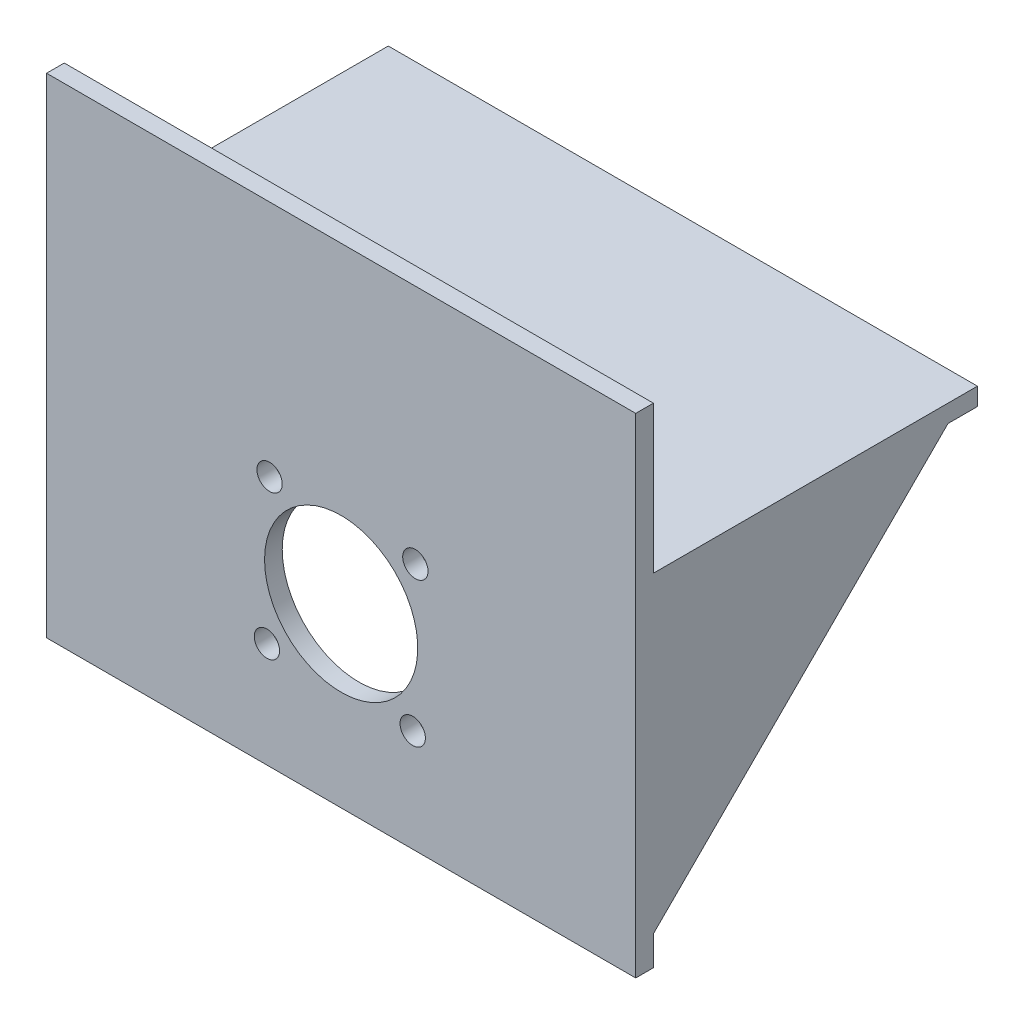
ISO-10303-21;
HEADER;
FILE_DESCRIPTION(('STEP AP214'),'2;1');
FILE_NAME('part.step','',(''),(''),'','','');
FILE_SCHEMA(('AUTOMOTIVE_DESIGN { 1 0 10303 214 1 1 1 1 }'));
ENDSEC;
DATA;
#1=APPLICATION_CONTEXT('core data for automotive mechanical design processes');
#2=APPLICATION_PROTOCOL_DEFINITION('international standard','automotive_design',2000,#1);
#3=PRODUCT_CONTEXT('',#1,'mechanical');
#4=PRODUCT('Part','Part','',(#3));
#5=PRODUCT_RELATED_PRODUCT_CATEGORY('part','',(#4));
#6=PRODUCT_DEFINITION_FORMATION('','',#4);
#7=PRODUCT_DEFINITION_CONTEXT('part definition',#1,'design');
#8=PRODUCT_DEFINITION('design','',#6,#7);
#9=PRODUCT_DEFINITION_SHAPE('','',#8);
#10=(LENGTH_UNIT() NAMED_UNIT(*) SI_UNIT(.MILLI.,.METRE.));
#11=(NAMED_UNIT(*) PLANE_ANGLE_UNIT() SI_UNIT($,.RADIAN.));
#12=(NAMED_UNIT(*) SI_UNIT($,.STERADIAN.) SOLID_ANGLE_UNIT());
#13=UNCERTAINTY_MEASURE_WITH_UNIT(LENGTH_MEASURE(1.E-05),#10,'distance_accuracy_value','');
#14=(GEOMETRIC_REPRESENTATION_CONTEXT(3) GLOBAL_UNCERTAINTY_ASSIGNED_CONTEXT((#13)) GLOBAL_UNIT_ASSIGNED_CONTEXT((#10,
#11,#12)) REPRESENTATION_CONTEXT('',''));
#15=CARTESIAN_POINT('',(0.,0.,0.));
#16=DIRECTION('',(0.,0.,1.));
#17=DIRECTION('',(1.,0.,0.));
#18=AXIS2_PLACEMENT_3D('',#15,#16,#17);
#19=CARTESIAN_POINT('',(-50.,3.,-27.5));
#20=DIRECTION('',(1.,0.,0.));
#21=DIRECTION('',(0.,0.,-1.));
#22=AXIS2_PLACEMENT_3D('',#19,#20,#21);
#23=PLANE('',#22);
#24=DIRECTION('',(0.,0.,1.));
#25=VECTOR('',#24,1.);
#26=CARTESIAN_POINT('',(-50.,0.,-27.5));
#27=LINE('',#26,#25);
#28=CARTESIAN_POINT('',(-50.,0.,-27.5));
#29=VERTEX_POINT('',#28);
#30=CARTESIAN_POINT('',(-50.,0.,-22.5));
#31=VERTEX_POINT('',#30);
#32=EDGE_CURVE('E222',#29,#31,#27,.T.);
#33=ORIENTED_EDGE('',*,*,#32,.T.);
#34=DIRECTION('',(0.,-0.707106781186547,0.707106781186547));
#35=VECTOR('',#34,1.);
#36=CARTESIAN_POINT('',(-50.,-50.,27.5));
#37=LINE('',#36,#35);
#38=CARTESIAN_POINT('',(-50.,-50.,27.5));
#39=VERTEX_POINT('',#38);
#40=EDGE_CURVE('E52',#31,#39,#37,.T.);
#41=ORIENTED_EDGE('',*,*,#40,.T.);
#42=DIRECTION('',(0.,-1.,0.));
#43=VECTOR('',#42,1.);
#44=CARTESIAN_POINT('',(-50.,28.,27.5));
#45=LINE('',#44,#43);
#46=CARTESIAN_POINT('',(-50.,-55.,27.5));
#47=VERTEX_POINT('',#46);
#48=EDGE_CURVE('E176',#39,#47,#45,.T.);
#49=ORIENTED_EDGE('',*,*,#48,.T.);
#50=DIRECTION('',(0.,0.,-1.));
#51=VECTOR('',#50,1.);
#52=CARTESIAN_POINT('',(-50.,-55.,30.5));
#53=LINE('',#52,#51);
#54=CARTESIAN_POINT('',(-50.,-55.,30.5));
#55=VERTEX_POINT('',#54);
#56=EDGE_CURVE('E201',#55,#47,#53,.T.);
#57=ORIENTED_EDGE('',*,*,#56,.F.);
#58=DIRECTION('',(0.,-1.,0.));
#59=VECTOR('',#58,1.);
#60=CARTESIAN_POINT('',(-50.,28.,30.5));
#61=LINE('',#60,#59);
#62=CARTESIAN_POINT('',(-50.,28.,30.5));
#63=VERTEX_POINT('',#62);
#64=EDGE_CURVE('E179',#63,#55,#61,.T.);
#65=ORIENTED_EDGE('',*,*,#64,.F.);
#66=DIRECTION('',(0.,0.,-1.));
#67=VECTOR('',#66,1.);
#68=CARTESIAN_POINT('',(-50.,28.,30.5));
#69=LINE('',#68,#67);
#70=CARTESIAN_POINT('',(-50.,28.,27.5));
#71=VERTEX_POINT('',#70);
#72=EDGE_CURVE('E189',#63,#71,#69,.T.);
#73=ORIENTED_EDGE('',*,*,#72,.T.);
#74=CARTESIAN_POINT('',(-50.,3.,27.5));
#75=VERTEX_POINT('',#74);
#76=EDGE_CURVE('E197',#71,#75,#45,.T.);
#77=ORIENTED_EDGE('',*,*,#76,.T.);
#78=DIRECTION('',(0.,0.,1.));
#79=VECTOR('',#78,1.);
#80=CARTESIAN_POINT('',(-50.,3.,-27.5));
#81=LINE('',#80,#79);
#82=CARTESIAN_POINT('',(-50.,3.,-27.5));
#83=VERTEX_POINT('',#82);
#84=EDGE_CURVE('E236',#83,#75,#81,.T.);
#85=ORIENTED_EDGE('',*,*,#84,.F.);
#86=DIRECTION('',(0.,-1.,0.));
#87=VECTOR('',#86,1.);
#88=CARTESIAN_POINT('',(-50.,3.,-27.5));
#89=LINE('',#88,#87);
#90=EDGE_CURVE('E44',#83,#29,#89,.T.);
#91=ORIENTED_EDGE('',*,*,#90,.T.);
#92=EDGE_LOOP('',(#33,#41,#49,#57,#65,#73,#77,#85,#91));
#93=FACE_BOUND('',#92,.T.);
#94=ADVANCED_FACE('F35',(#93),#23,.F.);
#95=CARTESIAN_POINT('',(50.,3.,-27.5));
#96=DIRECTION('',(-1.,0.,0.));
#97=DIRECTION('',(0.,0.,1.));
#98=AXIS2_PLACEMENT_3D('',#95,#96,#97);
#99=PLANE('',#98);
#100=DIRECTION('',(0.,0.707106781186547,-0.707106781186547));
#101=VECTOR('',#100,1.);
#102=CARTESIAN_POINT('',(50.,0.,-22.5));
#103=LINE('',#102,#101);
#104=CARTESIAN_POINT('',(50.,-50.,27.5));
#105=VERTEX_POINT('',#104);
#106=CARTESIAN_POINT('',(50.,0.,-22.5));
#107=VERTEX_POINT('',#106);
#108=EDGE_CURVE('E162',#105,#107,#103,.T.);
#109=ORIENTED_EDGE('',*,*,#108,.T.);
#110=DIRECTION('',(0.,0.,-1.));
#111=VECTOR('',#110,1.);
#112=CARTESIAN_POINT('',(50.,0.,-27.5));
#113=LINE('',#112,#111);
#114=CARTESIAN_POINT('',(50.,0.,-27.5));
#115=VERTEX_POINT('',#114);
#116=EDGE_CURVE('E226',#107,#115,#113,.T.);
#117=ORIENTED_EDGE('',*,*,#116,.T.);
#118=DIRECTION('',(0.,-1.,0.));
#119=VECTOR('',#118,1.);
#120=CARTESIAN_POINT('',(50.,3.,-27.5));
#121=LINE('',#120,#119);
#122=CARTESIAN_POINT('',(50.,3.,-27.5));
#123=VERTEX_POINT('',#122);
#124=EDGE_CURVE('E11',#123,#115,#121,.T.);
#125=ORIENTED_EDGE('',*,*,#124,.F.);
#126=DIRECTION('',(0.,0.,-1.));
#127=VECTOR('',#126,1.);
#128=CARTESIAN_POINT('',(50.,3.,-27.5));
#129=LINE('',#128,#127);
#130=CARTESIAN_POINT('',(50.,3.,27.5));
#131=VERTEX_POINT('',#130);
#132=EDGE_CURVE('E244',#131,#123,#129,.T.);
#133=ORIENTED_EDGE('',*,*,#132,.F.);
#134=DIRECTION('',(0.,1.,0.));
#135=VECTOR('',#134,1.);
#136=CARTESIAN_POINT('',(50.,28.,27.5));
#137=LINE('',#136,#135);
#138=CARTESIAN_POINT('',(50.,28.,27.5));
#139=VERTEX_POINT('',#138);
#140=EDGE_CURVE('E81',#131,#139,#137,.T.);
#141=ORIENTED_EDGE('',*,*,#140,.T.);
#142=DIRECTION('',(0.,0.,-1.));
#143=VECTOR('',#142,1.);
#144=CARTESIAN_POINT('',(50.,28.,30.5));
#145=LINE('',#144,#143);
#146=CARTESIAN_POINT('',(50.,28.,30.5));
#147=VERTEX_POINT('',#146);
#148=EDGE_CURVE('E213',#147,#139,#145,.T.);
#149=ORIENTED_EDGE('',*,*,#148,.F.);
#150=DIRECTION('',(0.,1.,0.));
#151=VECTOR('',#150,1.);
#152=CARTESIAN_POINT('',(50.,28.,30.5));
#153=LINE('',#152,#151);
#154=CARTESIAN_POINT('',(50.,-55.,30.5));
#155=VERTEX_POINT('',#154);
#156=EDGE_CURVE('E185',#155,#147,#153,.T.);
#157=ORIENTED_EDGE('',*,*,#156,.F.);
#158=DIRECTION('',(0.,0.,-1.));
#159=VECTOR('',#158,1.);
#160=CARTESIAN_POINT('',(50.,-55.,30.5));
#161=LINE('',#160,#159);
#162=CARTESIAN_POINT('',(50.,-55.,27.5));
#163=VERTEX_POINT('',#162);
#164=EDGE_CURVE('E215',#155,#163,#161,.T.);
#165=ORIENTED_EDGE('',*,*,#164,.T.);
#166=EDGE_CURVE('E203',#163,#105,#137,.T.);
#167=ORIENTED_EDGE('',*,*,#166,.T.);
#168=EDGE_LOOP('',(#109,#117,#125,#133,#141,#149,#157,#165,#167));
#169=FACE_BOUND('',#168,.T.);
#170=ADVANCED_FACE('F249',(#169),#99,.F.);
#171=CARTESIAN_POINT('',(-50.,3.,-27.5));
#172=DIRECTION('',(0.,0.,1.));
#173=DIRECTION('',(1.,0.,0.));
#174=AXIS2_PLACEMENT_3D('',#171,#172,#173);
#175=PLANE('',#174);
#176=DIRECTION('',(-1.,0.,0.));
#177=VECTOR('',#176,1.);
#178=CARTESIAN_POINT('',(-50.,0.,-27.5));
#179=LINE('',#178,#177);
#180=EDGE_CURVE('E74',#115,#29,#179,.T.);
#181=ORIENTED_EDGE('',*,*,#180,.T.);
#182=ORIENTED_EDGE('',*,*,#90,.F.);
#183=DIRECTION('',(-1.,0.,0.));
#184=VECTOR('',#183,1.);
#185=CARTESIAN_POINT('',(-50.,3.,-27.5));
#186=LINE('',#185,#184);
#187=EDGE_CURVE('E61',#123,#83,#186,.T.);
#188=ORIENTED_EDGE('',*,*,#187,.F.);
#189=ORIENTED_EDGE('',*,*,#124,.T.);
#190=EDGE_LOOP('',(#181,#182,#188,#189));
#191=FACE_BOUND('',#190,.T.);
#192=ADVANCED_FACE('F250',(#191),#175,.F.);
#193=CARTESIAN_POINT('',(0.,3.,0.));
#194=DIRECTION('',(0.,1.,0.));
#195=DIRECTION('',(0.,0.,1.));
#196=AXIS2_PLACEMENT_3D('',#193,#194,#195);
#197=PLANE('',#196);
#198=ORIENTED_EDGE('',*,*,#84,.T.);
#199=DIRECTION('',(1.,0.,0.));
#200=VECTOR('',#199,1.);
#201=CARTESIAN_POINT('',(-50.,3.,27.5));
#202=LINE('',#201,#200);
#203=EDGE_CURVE('E238',#75,#131,#202,.T.);
#204=ORIENTED_EDGE('',*,*,#203,.T.);
#205=ORIENTED_EDGE('',*,*,#132,.T.);
#206=ORIENTED_EDGE('',*,*,#187,.T.);
#207=EDGE_LOOP('',(#198,#204,#205,#206));
#208=FACE_BOUND('',#207,.T.);
#209=ADVANCED_FACE('F248',(#208),#197,.T.);
#210=CARTESIAN_POINT('',(0.,0.,0.));
#211=DIRECTION('',(0.,1.,0.));
#212=DIRECTION('',(0.,0.,1.));
#213=AXIS2_PLACEMENT_3D('',#210,#211,#212);
#214=PLANE('',#213);
#215=DIRECTION('',(0.,0.,-1.));
#216=VECTOR('',#215,1.);
#217=CARTESIAN_POINT('',(-47.,0.,-22.5));
#218=LINE('',#217,#216);
#219=CARTESIAN_POINT('',(-47.,0.,27.5));
#220=VERTEX_POINT('',#219);
#221=CARTESIAN_POINT('',(-47.,0.,-22.5));
#222=VERTEX_POINT('',#221);
#223=EDGE_CURVE('E147',#220,#222,#218,.T.);
#224=ORIENTED_EDGE('',*,*,#223,.T.);
#225=DIRECTION('',(-1.,0.,0.));
#226=VECTOR('',#225,1.);
#227=CARTESIAN_POINT('',(-47.,0.,-22.5));
#228=LINE('',#227,#226);
#229=EDGE_CURVE('E134',#222,#31,#228,.T.);
#230=ORIENTED_EDGE('',*,*,#229,.T.);
#231=ORIENTED_EDGE('',*,*,#32,.F.);
#232=ORIENTED_EDGE('',*,*,#180,.F.);
#233=ORIENTED_EDGE('',*,*,#116,.F.);
#234=DIRECTION('',(1.,0.,0.));
#235=VECTOR('',#234,1.);
#236=CARTESIAN_POINT('',(47.,0.,-22.5));
#237=LINE('',#236,#235);
#238=CARTESIAN_POINT('',(47.,0.,-22.5));
#239=VERTEX_POINT('',#238);
#240=EDGE_CURVE('E174',#239,#107,#237,.T.);
#241=ORIENTED_EDGE('',*,*,#240,.F.);
#242=DIRECTION('',(0.,0.,1.));
#243=VECTOR('',#242,1.);
#244=CARTESIAN_POINT('',(47.,0.,27.5));
#245=LINE('',#244,#243);
#246=CARTESIAN_POINT('',(47.,0.,27.5));
#247=VERTEX_POINT('',#246);
#248=EDGE_CURVE('E169',#239,#247,#245,.T.);
#249=ORIENTED_EDGE('',*,*,#248,.T.);
#250=DIRECTION('',(1.,0.,0.));
#251=VECTOR('',#250,1.);
#252=CARTESIAN_POINT('',(-50.,0.,27.5));
#253=LINE('',#252,#251);
#254=EDGE_CURVE('E38',#220,#247,#253,.T.);
#255=ORIENTED_EDGE('',*,*,#254,.F.);
#256=EDGE_LOOP('',(#224,#230,#231,#232,#233,#241,#249,#255));
#257=FACE_BOUND('',#256,.T.);
#258=ADVANCED_FACE('F152',(#257),#214,.F.);
#259=CARTESIAN_POINT('',(0.,0.,27.5));
#260=DIRECTION('',(0.,0.,1.));
#261=DIRECTION('',(1.,0.,0.));
#262=AXIS2_PLACEMENT_3D('',#259,#260,#261);
#263=PLANE('',#262);
#264=CARTESIAN_POINT('',(12.5959087524342,-12.8512106487793,27.5));
#265=DIRECTION('',(0.,0.,-1.));
#266=DIRECTION('',(-1.,0.,0.));
#267=AXIS2_PLACEMENT_3D('',#264,#265,#266);
#268=CIRCLE('',#267,2.15);
#269=CARTESIAN_POINT('',(10.4459087524342,-12.8512106487793,27.5));
#270=VERTEX_POINT('',#269);
#271=EDGE_CURVE('E339',#270,#270,#268,.T.);
#272=ORIENTED_EDGE('',*,*,#271,.F.);
#273=EDGE_LOOP('',(#272));
#274=FACE_BOUND('',#273,.T.);
#275=CARTESIAN_POINT('',(12.1487893512206,-37.595908752435,27.5));
#276=DIRECTION('',(0.,0.,-1.));
#277=DIRECTION('',(-1.,0.,0.));
#278=AXIS2_PLACEMENT_3D('',#275,#276,#277);
#279=CIRCLE('',#278,2.15);
#280=CARTESIAN_POINT('',(9.99878935122061,-37.595908752435,27.5));
#281=VERTEX_POINT('',#280);
#282=EDGE_CURVE('E335',#281,#281,#279,.T.);
#283=ORIENTED_EDGE('',*,*,#282,.F.);
#284=EDGE_LOOP('',(#283));
#285=FACE_BOUND('',#284,.T.);
#286=CARTESIAN_POINT('',(-12.5959087524351,-37.1487893512213,27.5));
#287=DIRECTION('',(0.,0.,-1.));
#288=DIRECTION('',(-1.,0.,0.));
#289=AXIS2_PLACEMENT_3D('',#286,#287,#288);
#290=CIRCLE('',#289,2.15);
#291=CARTESIAN_POINT('',(-14.7459087524351,-37.1487893512213,27.5));
#292=VERTEX_POINT('',#291);
#293=EDGE_CURVE('E331',#292,#292,#290,.T.);
#294=ORIENTED_EDGE('',*,*,#293,.F.);
#295=EDGE_LOOP('',(#294));
#296=FACE_BOUND('',#295,.T.);
#297=CARTESIAN_POINT('',(-12.1487893512213,-12.4040912475656,27.5));
#298=DIRECTION('',(0.,0.,-1.));
#299=DIRECTION('',(-1.,0.,0.));
#300=AXIS2_PLACEMENT_3D('',#297,#298,#299);
#301=CIRCLE('',#300,2.15);
#302=CARTESIAN_POINT('',(-14.2987893512213,-12.4040912475656,27.5));
#303=VERTEX_POINT('',#302);
#304=EDGE_CURVE('E327',#303,#303,#301,.T.);
#305=ORIENTED_EDGE('',*,*,#304,.F.);
#306=EDGE_LOOP('',(#305));
#307=FACE_BOUND('',#306,.T.);
#308=CARTESIAN_POINT('',(0.,-25.,27.5));
#309=DIRECTION('',(0.,0.,-1.));
#310=DIRECTION('',(-1.,0.,0.));
#311=AXIS2_PLACEMENT_3D('',#308,#309,#310);
#312=CIRCLE('',#311,13.);
#313=CARTESIAN_POINT('',(-13.,-25.,27.5));
#314=VERTEX_POINT('',#313);
#315=EDGE_CURVE('E158',#314,#314,#312,.T.);
#316=ORIENTED_EDGE('',*,*,#315,.F.);
#317=EDGE_LOOP('',(#316));
#318=FACE_BOUND('',#317,.T.);
#319=ORIENTED_EDGE('',*,*,#48,.F.);
#320=DIRECTION('',(-1.,0.,0.));
#321=VECTOR('',#320,1.);
#322=CARTESIAN_POINT('',(-47.,-50.,27.5));
#323=LINE('',#322,#321);
#324=CARTESIAN_POINT('',(-47.,-50.,27.5));
#325=VERTEX_POINT('',#324);
#326=EDGE_CURVE('E142',#325,#39,#323,.T.);
#327=ORIENTED_EDGE('',*,*,#326,.F.);
#328=DIRECTION('',(0.,1.,0.));
#329=VECTOR('',#328,1.);
#330=CARTESIAN_POINT('',(-47.,0.,27.5));
#331=LINE('',#330,#329);
#332=EDGE_CURVE('E143',#325,#220,#331,.T.);
#333=ORIENTED_EDGE('',*,*,#332,.T.);
#334=ORIENTED_EDGE('',*,*,#254,.T.);
#335=DIRECTION('',(0.,-1.,0.));
#336=VECTOR('',#335,1.);
#337=CARTESIAN_POINT('',(47.,-50.,27.5));
#338=LINE('',#337,#336);
#339=CARTESIAN_POINT('',(47.,-50.,27.5));
#340=VERTEX_POINT('',#339);
#341=EDGE_CURVE('E164',#247,#340,#338,.T.);
#342=ORIENTED_EDGE('',*,*,#341,.T.);
#343=DIRECTION('',(1.,0.,0.));
#344=VECTOR('',#343,1.);
#345=CARTESIAN_POINT('',(47.,-50.,27.5));
#346=LINE('',#345,#344);
#347=EDGE_CURVE('E171',#340,#105,#346,.T.);
#348=ORIENTED_EDGE('',*,*,#347,.T.);
#349=ORIENTED_EDGE('',*,*,#166,.F.);
#350=DIRECTION('',(1.,0.,0.));
#351=VECTOR('',#350,1.);
#352=CARTESIAN_POINT('',(-50.,-55.,27.5));
#353=LINE('',#352,#351);
#354=EDGE_CURVE('E192',#47,#163,#353,.T.);
#355=ORIENTED_EDGE('',*,*,#354,.F.);
#356=EDGE_LOOP('',(#319,#327,#333,#334,#342,#348,#349,#355));
#357=FACE_BOUND('',#356,.T.);
#358=ADVANCED_FACE('F264',(#274,#285,#296,#307,#318,#357),#263,.F.);
#359=CARTESIAN_POINT('',(-50.,-55.,30.5));
#360=DIRECTION('',(0.,1.,0.));
#361=DIRECTION('',(0.,0.,1.));
#362=AXIS2_PLACEMENT_3D('',#359,#360,#361);
#363=PLANE('',#362);
#364=ORIENTED_EDGE('',*,*,#354,.T.);
#365=ORIENTED_EDGE('',*,*,#164,.F.);
#366=DIRECTION('',(1.,0.,0.));
#367=VECTOR('',#366,1.);
#368=CARTESIAN_POINT('',(-50.,-55.,30.5));
#369=LINE('',#368,#367);
#370=EDGE_CURVE('E182',#55,#155,#369,.T.);
#371=ORIENTED_EDGE('',*,*,#370,.F.);
#372=ORIENTED_EDGE('',*,*,#56,.T.);
#373=EDGE_LOOP('',(#364,#365,#371,#372));
#374=FACE_BOUND('',#373,.T.);
#375=ADVANCED_FACE('F261',(#374),#363,.F.);
#376=CARTESIAN_POINT('',(-50.,28.,30.5));
#377=DIRECTION('',(0.,-1.,0.));
#378=DIRECTION('',(1.,0.,0.));
#379=AXIS2_PLACEMENT_3D('',#376,#377,#378);
#380=PLANE('',#379);
#381=DIRECTION('',(-1.,0.,0.));
#382=VECTOR('',#381,1.);
#383=CARTESIAN_POINT('',(-50.,28.,27.5));
#384=LINE('',#383,#382);
#385=EDGE_CURVE('E183',#139,#71,#384,.T.);
#386=ORIENTED_EDGE('',*,*,#385,.T.);
#387=ORIENTED_EDGE('',*,*,#72,.F.);
#388=DIRECTION('',(-1.,0.,0.));
#389=VECTOR('',#388,1.);
#390=CARTESIAN_POINT('',(-50.,28.,30.5));
#391=LINE('',#390,#389);
#392=EDGE_CURVE('E187',#147,#63,#391,.T.);
#393=ORIENTED_EDGE('',*,*,#392,.F.);
#394=ORIENTED_EDGE('',*,*,#148,.T.);
#395=EDGE_LOOP('',(#386,#387,#393,#394));
#396=FACE_BOUND('',#395,.T.);
#397=ADVANCED_FACE('F257',(#396),#380,.F.);
#398=CARTESIAN_POINT('',(0.,0.,30.5));
#399=DIRECTION('',(0.,0.,1.));
#400=DIRECTION('',(1.,0.,0.));
#401=AXIS2_PLACEMENT_3D('',#398,#399,#400);
#402=PLANE('',#401);
#403=CARTESIAN_POINT('',(12.5959087524342,-12.8512106487793,30.5));
#404=DIRECTION('',(0.,0.,-1.));
#405=DIRECTION('',(-1.,0.,0.));
#406=AXIS2_PLACEMENT_3D('',#403,#404,#405);
#407=CIRCLE('',#406,2.15);
#408=CARTESIAN_POINT('',(10.4459087524342,-12.8512106487793,30.5));
#409=VERTEX_POINT('',#408);
#410=EDGE_CURVE('E308',#409,#409,#407,.T.);
#411=ORIENTED_EDGE('',*,*,#410,.T.);
#412=EDGE_LOOP('',(#411));
#413=FACE_BOUND('',#412,.T.);
#414=CARTESIAN_POINT('',(12.1487893512206,-37.595908752435,30.5));
#415=DIRECTION('',(0.,0.,-1.));
#416=DIRECTION('',(-1.,0.,0.));
#417=AXIS2_PLACEMENT_3D('',#414,#415,#416);
#418=CIRCLE('',#417,2.15);
#419=CARTESIAN_POINT('',(9.99878935122061,-37.595908752435,30.5));
#420=VERTEX_POINT('',#419);
#421=EDGE_CURVE('E312',#420,#420,#418,.T.);
#422=ORIENTED_EDGE('',*,*,#421,.T.);
#423=EDGE_LOOP('',(#422));
#424=FACE_BOUND('',#423,.T.);
#425=CARTESIAN_POINT('',(-12.5959087524351,-37.1487893512213,30.5));
#426=DIRECTION('',(0.,0.,-1.));
#427=DIRECTION('',(-1.,0.,0.));
#428=AXIS2_PLACEMENT_3D('',#425,#426,#427);
#429=CIRCLE('',#428,2.15);
#430=CARTESIAN_POINT('',(-14.7459087524351,-37.1487893512213,30.5));
#431=VERTEX_POINT('',#430);
#432=EDGE_CURVE('E316',#431,#431,#429,.T.);
#433=ORIENTED_EDGE('',*,*,#432,.T.);
#434=EDGE_LOOP('',(#433));
#435=FACE_BOUND('',#434,.T.);
#436=CARTESIAN_POINT('',(-12.1487893512213,-12.4040912475656,30.5));
#437=DIRECTION('',(0.,0.,-1.));
#438=DIRECTION('',(-1.,0.,0.));
#439=AXIS2_PLACEMENT_3D('',#436,#437,#438);
#440=CIRCLE('',#439,2.15);
#441=CARTESIAN_POINT('',(-14.2987893512213,-12.4040912475656,30.5));
#442=VERTEX_POINT('',#441);
#443=EDGE_CURVE('E320',#442,#442,#440,.T.);
#444=ORIENTED_EDGE('',*,*,#443,.T.);
#445=EDGE_LOOP('',(#444));
#446=FACE_BOUND('',#445,.T.);
#447=CARTESIAN_POINT('',(0.,-25.,30.5));
#448=DIRECTION('',(0.,0.,-1.));
#449=DIRECTION('',(-1.,0.,0.));
#450=AXIS2_PLACEMENT_3D('',#447,#448,#449);
#451=CIRCLE('',#450,13.);
#452=CARTESIAN_POINT('',(-13.,-25.,30.5));
#453=VERTEX_POINT('',#452);
#454=EDGE_CURVE('E155',#453,#453,#451,.T.);
#455=ORIENTED_EDGE('',*,*,#454,.T.);
#456=EDGE_LOOP('',(#455));
#457=FACE_BOUND('',#456,.T.);
#458=ORIENTED_EDGE('',*,*,#64,.T.);
#459=ORIENTED_EDGE('',*,*,#370,.T.);
#460=ORIENTED_EDGE('',*,*,#156,.T.);
#461=ORIENTED_EDGE('',*,*,#392,.T.);
#462=EDGE_LOOP('',(#458,#459,#460,#461));
#463=FACE_BOUND('',#462,.T.);
#464=ADVANCED_FACE('F298',(#413,#424,#435,#446,#457,#463),#402,.T.);
#465=ORIENTED_EDGE('',*,*,#203,.F.);
#466=ORIENTED_EDGE('',*,*,#76,.F.);
#467=ORIENTED_EDGE('',*,*,#385,.F.);
#468=ORIENTED_EDGE('',*,*,#140,.F.);
#469=EDGE_LOOP('',(#465,#466,#467,#468));
#470=FACE_BOUND('',#469,.T.);
#471=ADVANCED_FACE('F255',(#470),#263,.F.);
#472=CARTESIAN_POINT('',(47.,0.,-22.5));
#473=DIRECTION('',(0.,-0.707106781186548,-0.707106781186548));
#474=DIRECTION('',(0.,0.707106781186548,-0.707106781186548));
#475=AXIS2_PLACEMENT_3D('',#472,#473,#474);
#476=PLANE('',#475);
#477=ORIENTED_EDGE('',*,*,#108,.F.);
#478=ORIENTED_EDGE('',*,*,#347,.F.);
#479=DIRECTION('',(0.,0.707106781186547,-0.707106781186547));
#480=VECTOR('',#479,1.);
#481=CARTESIAN_POINT('',(47.,0.,-22.5));
#482=LINE('',#481,#480);
#483=EDGE_CURVE('E167',#340,#239,#482,.T.);
#484=ORIENTED_EDGE('',*,*,#483,.T.);
#485=ORIENTED_EDGE('',*,*,#240,.T.);
#486=EDGE_LOOP('',(#477,#478,#484,#485));
#487=FACE_BOUND('',#486,.T.);
#488=ADVANCED_FACE('F268',(#487),#476,.T.);
#489=CARTESIAN_POINT('',(47.,0.,0.));
#490=DIRECTION('',(-1.,0.,0.));
#491=DIRECTION('',(0.,0.,1.));
#492=AXIS2_PLACEMENT_3D('',#489,#490,#491);
#493=PLANE('',#492);
#494=ORIENTED_EDGE('',*,*,#341,.F.);
#495=ORIENTED_EDGE('',*,*,#248,.F.);
#496=ORIENTED_EDGE('',*,*,#483,.F.);
#497=EDGE_LOOP('',(#494,#495,#496));
#498=FACE_BOUND('',#497,.T.);
#499=ADVANCED_FACE('F272',(#498),#493,.T.);
#500=CARTESIAN_POINT('',(-47.,-50.,27.5));
#501=DIRECTION('',(0.,-0.707106781186548,-0.707106781186548));
#502=DIRECTION('',(0.,0.707106781186548,-0.707106781186548));
#503=AXIS2_PLACEMENT_3D('',#500,#501,#502);
#504=PLANE('',#503);
#505=ORIENTED_EDGE('',*,*,#40,.F.);
#506=ORIENTED_EDGE('',*,*,#229,.F.);
#507=DIRECTION('',(0.,-0.707106781186547,0.707106781186547));
#508=VECTOR('',#507,1.);
#509=CARTESIAN_POINT('',(-47.,-50.,27.5));
#510=LINE('',#509,#508);
#511=EDGE_CURVE('E137',#222,#325,#510,.T.);
#512=ORIENTED_EDGE('',*,*,#511,.T.);
#513=ORIENTED_EDGE('',*,*,#326,.T.);
#514=EDGE_LOOP('',(#505,#506,#512,#513));
#515=FACE_BOUND('',#514,.T.);
#516=ADVANCED_FACE('F136',(#515),#504,.T.);
#517=CARTESIAN_POINT('',(-47.,0.,0.));
#518=DIRECTION('',(1.,0.,0.));
#519=DIRECTION('',(0.,0.,-1.));
#520=AXIS2_PLACEMENT_3D('',#517,#518,#519);
#521=PLANE('',#520);
#522=ORIENTED_EDGE('',*,*,#223,.F.);
#523=ORIENTED_EDGE('',*,*,#332,.F.);
#524=ORIENTED_EDGE('',*,*,#511,.F.);
#525=EDGE_LOOP('',(#522,#523,#524));
#526=FACE_BOUND('',#525,.T.);
#527=ADVANCED_FACE('F146',(#526),#521,.T.);
#528=CARTESIAN_POINT('',(0.,-25.,30.5));
#529=DIRECTION('',(0.,0.,-1.));
#530=DIRECTION('',(-1.,0.,0.));
#531=AXIS2_PLACEMENT_3D('',#528,#529,#530);
#532=CYLINDRICAL_SURFACE('',#531,13.);
#533=ORIENTED_EDGE('',*,*,#454,.F.);
#534=EDGE_LOOP('',(#533));
#535=FACE_BOUND('',#534,.T.);
#536=ORIENTED_EDGE('',*,*,#315,.T.);
#537=EDGE_LOOP('',(#536));
#538=FACE_BOUND('',#537,.T.);
#539=ADVANCED_FACE('F356',(#535,#538),#532,.F.);
#540=CARTESIAN_POINT('',(-12.1487893512213,-12.4040912475656,30.5));
#541=DIRECTION('',(0.,0.,-1.));
#542=DIRECTION('',(-1.,0.,0.));
#543=AXIS2_PLACEMENT_3D('',#540,#541,#542);
#544=CYLINDRICAL_SURFACE('',#543,2.15);
#545=ORIENTED_EDGE('',*,*,#443,.F.);
#546=EDGE_LOOP('',(#545));
#547=FACE_BOUND('',#546,.T.);
#548=ORIENTED_EDGE('',*,*,#304,.T.);
#549=EDGE_LOOP('',(#548));
#550=FACE_BOUND('',#549,.T.);
#551=ADVANCED_FACE('F358',(#547,#550),#544,.F.);
#552=CARTESIAN_POINT('',(-12.5959087524351,-37.1487893512213,30.5));
#553=DIRECTION('',(0.,0.,-1.));
#554=DIRECTION('',(-1.,0.,0.));
#555=AXIS2_PLACEMENT_3D('',#552,#553,#554);
#556=CYLINDRICAL_SURFACE('',#555,2.15);
#557=ORIENTED_EDGE('',*,*,#432,.F.);
#558=EDGE_LOOP('',(#557));
#559=FACE_BOUND('',#558,.T.);
#560=ORIENTED_EDGE('',*,*,#293,.T.);
#561=EDGE_LOOP('',(#560));
#562=FACE_BOUND('',#561,.T.);
#563=ADVANCED_FACE('F364',(#559,#562),#556,.F.);
#564=CARTESIAN_POINT('',(12.1487893512206,-37.595908752435,30.5));
#565=DIRECTION('',(0.,0.,-1.));
#566=DIRECTION('',(-1.,0.,0.));
#567=AXIS2_PLACEMENT_3D('',#564,#565,#566);
#568=CYLINDRICAL_SURFACE('',#567,2.15);
#569=ORIENTED_EDGE('',*,*,#421,.F.);
#570=EDGE_LOOP('',(#569));
#571=FACE_BOUND('',#570,.T.);
#572=ORIENTED_EDGE('',*,*,#282,.T.);
#573=EDGE_LOOP('',(#572));
#574=FACE_BOUND('',#573,.T.);
#575=ADVANCED_FACE('F371',(#571,#574),#568,.F.);
#576=CARTESIAN_POINT('',(12.5959087524342,-12.8512106487793,30.5));
#577=DIRECTION('',(0.,0.,-1.));
#578=DIRECTION('',(-1.,0.,0.));
#579=AXIS2_PLACEMENT_3D('',#576,#577,#578);
#580=CYLINDRICAL_SURFACE('',#579,2.15);
#581=ORIENTED_EDGE('',*,*,#410,.F.);
#582=EDGE_LOOP('',(#581));
#583=FACE_BOUND('',#582,.T.);
#584=ORIENTED_EDGE('',*,*,#271,.T.);
#585=EDGE_LOOP('',(#584));
#586=FACE_BOUND('',#585,.T.);
#587=ADVANCED_FACE('F344',(#583,#586),#580,.F.);
#588=CLOSED_SHELL('',(#94,#170,#192,#209,#258,#358,#375,#397,#464,#471,#488,#499,#516,#527,#539,
#551,#563,#575,#587));
#589=MANIFOLD_SOLID_BREP('B2',#588);
#590=ADVANCED_BREP_SHAPE_REPRESENTATION('',(#18,#589),#14);
#591=SHAPE_DEFINITION_REPRESENTATION(#9,#590);
ENDSEC;
END-ISO-10303-21;
